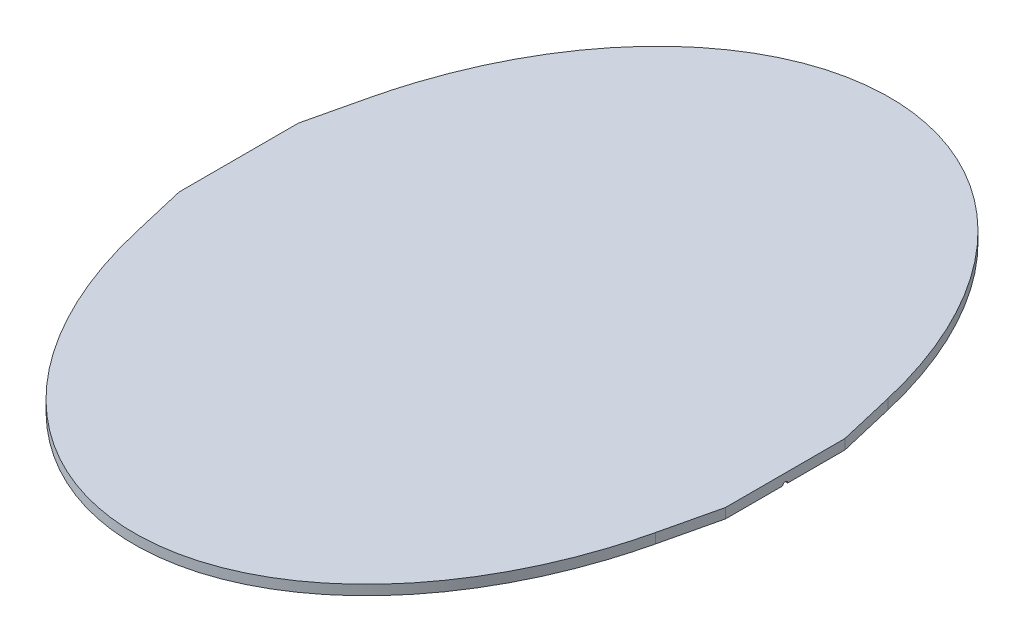
ISO-10303-21;
HEADER;
FILE_DESCRIPTION(('STEP AP214'),'2;1');
FILE_NAME('part.step','',(''),(''),'','','');
FILE_SCHEMA(('AUTOMOTIVE_DESIGN { 1 0 10303 214 1 1 1 1 }'));
ENDSEC;
DATA;
#1=APPLICATION_CONTEXT('core data for automotive mechanical design processes');
#2=APPLICATION_PROTOCOL_DEFINITION('international standard','automotive_design',2000,#1);
#3=PRODUCT_CONTEXT('',#1,'mechanical');
#4=PRODUCT('Part','Part','',(#3));
#5=PRODUCT_RELATED_PRODUCT_CATEGORY('part','',(#4));
#6=PRODUCT_DEFINITION_FORMATION('','',#4);
#7=PRODUCT_DEFINITION_CONTEXT('part definition',#1,'design');
#8=PRODUCT_DEFINITION('design','',#6,#7);
#9=PRODUCT_DEFINITION_SHAPE('','',#8);
#10=(LENGTH_UNIT() NAMED_UNIT(*) SI_UNIT(.MILLI.,.METRE.));
#11=(NAMED_UNIT(*) PLANE_ANGLE_UNIT() SI_UNIT($,.RADIAN.));
#12=(NAMED_UNIT(*) SI_UNIT($,.STERADIAN.) SOLID_ANGLE_UNIT());
#13=UNCERTAINTY_MEASURE_WITH_UNIT(LENGTH_MEASURE(1.E-05),#10,'distance_accuracy_value','');
#14=(GEOMETRIC_REPRESENTATION_CONTEXT(3) GLOBAL_UNCERTAINTY_ASSIGNED_CONTEXT((#13)) GLOBAL_UNIT_ASSIGNED_CONTEXT((#10,
#11,#12)) REPRESENTATION_CONTEXT('',''));
#15=CARTESIAN_POINT('',(0.,0.,0.));
#16=DIRECTION('',(0.,0.,1.));
#17=DIRECTION('',(1.,0.,0.));
#18=AXIS2_PLACEMENT_3D('',#15,#16,#17);
#19=CARTESIAN_POINT('',(0.,10.,0.));
#20=DIRECTION('',(0.,1.,0.));
#21=DIRECTION('',(0.,0.,-1.));
#22=AXIS2_PLACEMENT_3D('',#19,#20,#21);
#23=ELLIPSE('',#22,380.,275.);
#24=DIRECTION('',(0.,-1.,0.));
#25=VECTOR('',#24,1.);
#26=SURFACE_OF_LINEAR_EXTRUSION('',#23,#25);
#27=CARTESIAN_POINT('',(0.,0.,0.));
#28=DIRECTION('',(0.,1.,0.));
#29=DIRECTION('',(0.,0.,-1.));
#30=AXIS2_PLACEMENT_3D('',#27,#28,#29);
#31=ELLIPSE('',#30,380.,275.);
#32=CARTESIAN_POINT('',(261.621621621622,0.,-117.081081081081));
#33=VERTEX_POINT('',#32);
#34=CARTESIAN_POINT('',(-261.621621621622,0.,-117.081081081081));
#35=VERTEX_POINT('',#34);
#36=EDGE_CURVE('E38',#33,#35,#31,.T.);
#37=ORIENTED_EDGE('',*,*,#36,.T.);
#38=DIRECTION('',(0.,1.,0.));
#39=VECTOR('',#38,1.);
#40=CARTESIAN_POINT('',(-261.621621621622,0.,-117.081081081081));
#41=LINE('',#40,#39);
#42=CARTESIAN_POINT('',(-261.621621621622,10.,-117.081081081081));
#43=VERTEX_POINT('',#42);
#44=EDGE_CURVE('E178',#35,#43,#41,.T.);
#45=ORIENTED_EDGE('',*,*,#44,.T.);
#46=CARTESIAN_POINT('',(261.621621621622,10.,-117.081081081081));
#47=VERTEX_POINT('',#46);
#48=EDGE_CURVE('E11',#47,#43,#23,.T.);
#49=ORIENTED_EDGE('',*,*,#48,.F.);
#50=DIRECTION('',(0.,1.,0.));
#51=VECTOR('',#50,1.);
#52=CARTESIAN_POINT('',(261.621621621622,0.,-117.081081081081));
#53=LINE('',#52,#51);
#54=EDGE_CURVE('E199',#33,#47,#53,.T.);
#55=ORIENTED_EDGE('',*,*,#54,.F.);
#56=EDGE_LOOP('',(#37,#45,#49,#55));
#57=FACE_BOUND('',#56,.T.);
#58=ADVANCED_FACE('F33',(#57),#26,.F.);
#59=CARTESIAN_POINT('',(-261.621621621622,10.,117.081081081081));
#60=VERTEX_POINT('',#59);
#61=CARTESIAN_POINT('',(261.621621621622,10.,117.081081081081));
#62=VERTEX_POINT('',#61);
#63=EDGE_CURVE('E42',#60,#62,#23,.T.);
#64=ORIENTED_EDGE('',*,*,#63,.F.);
#65=DIRECTION('',(0.,1.,0.));
#66=VECTOR('',#65,1.);
#67=CARTESIAN_POINT('',(-261.621621621622,0.,117.081081081081));
#68=LINE('',#67,#66);
#69=CARTESIAN_POINT('',(-261.621621621622,0.,117.081081081081));
#70=VERTEX_POINT('',#69);
#71=EDGE_CURVE('E164',#70,#60,#68,.T.);
#72=ORIENTED_EDGE('',*,*,#71,.F.);
#73=CARTESIAN_POINT('',(261.621621621622,0.,117.081081081081));
#74=VERTEX_POINT('',#73);
#75=EDGE_CURVE('E201',#70,#74,#31,.T.);
#76=ORIENTED_EDGE('',*,*,#75,.T.);
#77=DIRECTION('',(0.,1.,0.));
#78=VECTOR('',#77,1.);
#79=CARTESIAN_POINT('',(261.621621621622,0.,117.081081081081));
#80=LINE('',#79,#78);
#81=EDGE_CURVE('E192',#74,#62,#80,.T.);
#82=ORIENTED_EDGE('',*,*,#81,.T.);
#83=EDGE_LOOP('',(#64,#72,#76,#82));
#84=FACE_BOUND('',#83,.T.);
#85=ADVANCED_FACE('F35',(#84),#26,.F.);
#86=CARTESIAN_POINT('',(0.,10.,0.));
#87=DIRECTION('',(0.,1.,0.));
#88=DIRECTION('',(0.,0.,1.));
#89=AXIS2_PLACEMENT_3D('',#86,#87,#88);
#90=PLANE('',#89);
#91=ORIENTED_EDGE('',*,*,#48,.T.);
#92=DIRECTION('',(-0.228191322789328,0.,0.973616310567801));
#93=VECTOR('',#92,1.);
#94=CARTESIAN_POINT('',(-261.621621621622,10.,-117.081081081081));
#95=LINE('',#94,#93);
#96=CARTESIAN_POINT('',(-275.,10.,-60.));
#97=VERTEX_POINT('',#96);
#98=EDGE_CURVE('E167',#43,#97,#95,.T.);
#99=ORIENTED_EDGE('',*,*,#98,.T.);
#100=DIRECTION('',(0.,0.,1.));
#101=VECTOR('',#100,1.);
#102=CARTESIAN_POINT('',(-275.,10.,0.));
#103=LINE('',#102,#101);
#104=CARTESIAN_POINT('',(-275.,10.,60.));
#105=VERTEX_POINT('',#104);
#106=EDGE_CURVE('E158',#97,#105,#103,.T.);
#107=ORIENTED_EDGE('',*,*,#106,.T.);
#108=DIRECTION('',(0.228191322789329,0.,0.973616310567801));
#109=VECTOR('',#108,1.);
#110=CARTESIAN_POINT('',(-275.,10.,60.));
#111=LINE('',#110,#109);
#112=EDGE_CURVE('E152',#105,#60,#111,.T.);
#113=ORIENTED_EDGE('',*,*,#112,.T.);
#114=ORIENTED_EDGE('',*,*,#63,.T.);
#115=DIRECTION('',(0.228191322789329,0.,-0.973616310567801));
#116=VECTOR('',#115,1.);
#117=CARTESIAN_POINT('',(275.,10.,60.));
#118=LINE('',#117,#116);
#119=CARTESIAN_POINT('',(275.,10.,60.));
#120=VERTEX_POINT('',#119);
#121=EDGE_CURVE('E174',#62,#120,#118,.T.);
#122=ORIENTED_EDGE('',*,*,#121,.T.);
#123=DIRECTION('',(0.,0.,-1.));
#124=VECTOR('',#123,1.);
#125=CARTESIAN_POINT('',(275.,10.,-60.));
#126=LINE('',#125,#124);
#127=CARTESIAN_POINT('',(275.,10.,-60.));
#128=VERTEX_POINT('',#127);
#129=EDGE_CURVE('E195',#120,#128,#126,.T.);
#130=ORIENTED_EDGE('',*,*,#129,.T.);
#131=DIRECTION('',(-0.228191322789328,0.,-0.973616310567801));
#132=VECTOR('',#131,1.);
#133=CARTESIAN_POINT('',(261.621621621622,10.,-117.081081081081));
#134=LINE('',#133,#132);
#135=EDGE_CURVE('E186',#128,#47,#134,.T.);
#136=ORIENTED_EDGE('',*,*,#135,.T.);
#137=EDGE_LOOP('',(#91,#99,#107,#113,#114,#122,#130,#136));
#138=FACE_BOUND('',#137,.T.);
#139=ADVANCED_FACE('F226',(#138),#90,.T.);
#140=CARTESIAN_POINT('',(0.,0.,0.));
#141=DIRECTION('',(0.,1.,0.));
#142=DIRECTION('',(0.,0.,1.));
#143=AXIS2_PLACEMENT_3D('',#140,#141,#142);
#144=PLANE('',#143);
#145=DIRECTION('',(0.,0.,1.));
#146=VECTOR('',#145,1.);
#147=CARTESIAN_POINT('',(-265.,0.,-2.5));
#148=LINE('',#147,#146);
#149=CARTESIAN_POINT('',(-265.,0.,-2.5));
#150=VERTEX_POINT('',#149);
#151=CARTESIAN_POINT('',(-265.,0.,2.50000000000001));
#152=VERTEX_POINT('',#151);
#153=EDGE_CURVE('E131',#150,#152,#148,.T.);
#154=ORIENTED_EDGE('',*,*,#153,.F.);
#155=DIRECTION('',(-1.,0.,0.));
#156=VECTOR('',#155,1.);
#157=CARTESIAN_POINT('',(-265.,0.,-2.5));
#158=LINE('',#157,#156);
#159=CARTESIAN_POINT('',(-275.,0.,-2.5));
#160=VERTEX_POINT('',#159);
#161=EDGE_CURVE('E121',#150,#160,#158,.T.);
#162=ORIENTED_EDGE('',*,*,#161,.T.);
#163=DIRECTION('',(0.,0.,1.));
#164=VECTOR('',#163,1.);
#165=CARTESIAN_POINT('',(-275.,0.,-60.));
#166=LINE('',#165,#164);
#167=CARTESIAN_POINT('',(-275.,0.,-60.));
#168=VERTEX_POINT('',#167);
#169=EDGE_CURVE('E162',#168,#160,#166,.T.);
#170=ORIENTED_EDGE('',*,*,#169,.F.);
#171=DIRECTION('',(-0.228191322789328,0.,0.973616310567801));
#172=VECTOR('',#171,1.);
#173=CARTESIAN_POINT('',(-261.621621621622,0.,-117.081081081081));
#174=LINE('',#173,#172);
#175=EDGE_CURVE('E157',#35,#168,#174,.T.);
#176=ORIENTED_EDGE('',*,*,#175,.F.);
#177=ORIENTED_EDGE('',*,*,#36,.F.);
#178=DIRECTION('',(-0.228191322789328,0.,-0.973616310567801));
#179=VECTOR('',#178,1.);
#180=CARTESIAN_POINT('',(261.621621621622,0.,-117.081081081081));
#181=LINE('',#180,#179);
#182=CARTESIAN_POINT('',(275.,0.,-60.));
#183=VERTEX_POINT('',#182);
#184=EDGE_CURVE('E190',#183,#33,#181,.T.);
#185=ORIENTED_EDGE('',*,*,#184,.F.);
#186=DIRECTION('',(0.,0.,-1.));
#187=VECTOR('',#186,1.);
#188=CARTESIAN_POINT('',(275.,0.,0.));
#189=LINE('',#188,#187);
#190=CARTESIAN_POINT('',(275.,0.,-2.49999999999999));
#191=VERTEX_POINT('',#190);
#192=EDGE_CURVE('E185',#191,#183,#189,.T.);
#193=ORIENTED_EDGE('',*,*,#192,.F.);
#194=DIRECTION('',(1.,0.,0.));
#195=VECTOR('',#194,1.);
#196=CARTESIAN_POINT('',(265.,0.,-2.5));
#197=LINE('',#196,#195);
#198=CARTESIAN_POINT('',(265.,0.,-2.5));
#199=VERTEX_POINT('',#198);
#200=EDGE_CURVE('E57',#199,#191,#197,.T.);
#201=ORIENTED_EDGE('',*,*,#200,.F.);
#202=DIRECTION('',(0.,0.,-1.));
#203=VECTOR('',#202,1.);
#204=CARTESIAN_POINT('',(265.,0.,2.5));
#205=LINE('',#204,#203);
#206=CARTESIAN_POINT('',(265.,0.,2.5));
#207=VERTEX_POINT('',#206);
#208=EDGE_CURVE('E146',#207,#199,#205,.T.);
#209=ORIENTED_EDGE('',*,*,#208,.F.);
#210=DIRECTION('',(1.,0.,0.));
#211=VECTOR('',#210,1.);
#212=CARTESIAN_POINT('',(265.,0.,2.5));
#213=LINE('',#212,#211);
#214=CARTESIAN_POINT('',(275.,0.,2.5));
#215=VERTEX_POINT('',#214);
#216=EDGE_CURVE('E149',#207,#215,#213,.T.);
#217=ORIENTED_EDGE('',*,*,#216,.T.);
#218=CARTESIAN_POINT('',(275.,0.,60.));
#219=VERTEX_POINT('',#218);
#220=EDGE_CURVE('E187',#219,#215,#189,.T.);
#221=ORIENTED_EDGE('',*,*,#220,.F.);
#222=DIRECTION('',(0.228191322789329,0.,-0.973616310567801));
#223=VECTOR('',#222,1.);
#224=CARTESIAN_POINT('',(275.,0.,60.));
#225=LINE('',#224,#223);
#226=EDGE_CURVE('E182',#74,#219,#225,.T.);
#227=ORIENTED_EDGE('',*,*,#226,.F.);
#228=ORIENTED_EDGE('',*,*,#75,.F.);
#229=DIRECTION('',(0.228191322789329,0.,0.973616310567801));
#230=VECTOR('',#229,1.);
#231=CARTESIAN_POINT('',(-275.,0.,60.));
#232=LINE('',#231,#230);
#233=CARTESIAN_POINT('',(-275.,0.,60.));
#234=VERTEX_POINT('',#233);
#235=EDGE_CURVE('E155',#234,#70,#232,.T.);
#236=ORIENTED_EDGE('',*,*,#235,.F.);
#237=CARTESIAN_POINT('',(-275.,0.,2.5));
#238=VERTEX_POINT('',#237);
#239=EDGE_CURVE('E161',#238,#234,#166,.T.);
#240=ORIENTED_EDGE('',*,*,#239,.F.);
#241=DIRECTION('',(-1.,0.,0.));
#242=VECTOR('',#241,1.);
#243=CARTESIAN_POINT('',(-265.,0.,2.50000000000001));
#244=LINE('',#243,#242);
#245=EDGE_CURVE('E49',#152,#238,#244,.T.);
#246=ORIENTED_EDGE('',*,*,#245,.F.);
#247=EDGE_LOOP('',(#154,#162,#170,#176,#177,#185,#193,#201,#209,#217,#221,#227,#228,#236,#240,#246));
#248=FACE_BOUND('',#247,.T.);
#249=ADVANCED_FACE('F136',(#248),#144,.F.);
#250=CARTESIAN_POINT('',(275.,0.,-60.));
#251=DIRECTION('',(1.,0.,0.));
#252=DIRECTION('',(0.,0.,-1.));
#253=AXIS2_PLACEMENT_3D('',#250,#251,#252);
#254=PLANE('',#253);
#255=CARTESIAN_POINT('',(275.,0.,0.));
#256=DIRECTION('',(1.,0.,0.));
#257=DIRECTION('',(0.,0.,-1.));
#258=AXIS2_PLACEMENT_3D('',#255,#256,#257);
#259=CIRCLE('',#258,2.5);
#260=EDGE_CURVE('E141',#191,#215,#259,.T.);
#261=ORIENTED_EDGE('',*,*,#260,.F.);
#262=ORIENTED_EDGE('',*,*,#192,.T.);
#263=DIRECTION('',(0.,1.,0.));
#264=VECTOR('',#263,1.);
#265=CARTESIAN_POINT('',(275.,0.,-60.));
#266=LINE('',#265,#264);
#267=EDGE_CURVE('E202',#183,#128,#266,.T.);
#268=ORIENTED_EDGE('',*,*,#267,.T.);
#269=ORIENTED_EDGE('',*,*,#129,.F.);
#270=DIRECTION('',(0.,1.,0.));
#271=VECTOR('',#270,1.);
#272=CARTESIAN_POINT('',(275.,0.,60.));
#273=LINE('',#272,#271);
#274=EDGE_CURVE('E205',#219,#120,#273,.T.);
#275=ORIENTED_EDGE('',*,*,#274,.F.);
#276=ORIENTED_EDGE('',*,*,#220,.T.);
#277=EDGE_LOOP('',(#261,#262,#268,#269,#275,#276));
#278=FACE_BOUND('',#277,.T.);
#279=ADVANCED_FACE('F223',(#278),#254,.T.);
#280=CARTESIAN_POINT('',(261.621621621622,0.,-117.081081081081));
#281=DIRECTION('',(0.973616310567801,0.,-0.228191322789328));
#282=DIRECTION('',(-0.228191322789328,0.,-0.973616310567801));
#283=AXIS2_PLACEMENT_3D('',#280,#281,#282);
#284=PLANE('',#283);
#285=ORIENTED_EDGE('',*,*,#135,.F.);
#286=ORIENTED_EDGE('',*,*,#267,.F.);
#287=ORIENTED_EDGE('',*,*,#184,.T.);
#288=ORIENTED_EDGE('',*,*,#54,.T.);
#289=EDGE_LOOP('',(#285,#286,#287,#288));
#290=FACE_BOUND('',#289,.T.);
#291=ADVANCED_FACE('F240',(#290),#284,.T.);
#292=CARTESIAN_POINT('',(275.,0.,60.));
#293=DIRECTION('',(0.973616310567801,0.,0.228191322789329));
#294=DIRECTION('',(0.228191322789329,0.,-0.973616310567801));
#295=AXIS2_PLACEMENT_3D('',#292,#293,#294);
#296=PLANE('',#295);
#297=ORIENTED_EDGE('',*,*,#121,.F.);
#298=ORIENTED_EDGE('',*,*,#81,.F.);
#299=ORIENTED_EDGE('',*,*,#226,.T.);
#300=ORIENTED_EDGE('',*,*,#274,.T.);
#301=EDGE_LOOP('',(#297,#298,#299,#300));
#302=FACE_BOUND('',#301,.T.);
#303=ADVANCED_FACE('F218',(#302),#296,.T.);
#304=CARTESIAN_POINT('',(-275.,0.,0.));
#305=DIRECTION('',(-1.,0.,0.));
#306=DIRECTION('',(0.,0.,1.));
#307=AXIS2_PLACEMENT_3D('',#304,#305,#306);
#308=PLANE('',#307);
#309=CARTESIAN_POINT('',(-275.,0.,0.));
#310=DIRECTION('',(-1.,0.,0.));
#311=DIRECTION('',(0.,0.,1.));
#312=AXIS2_PLACEMENT_3D('',#309,#310,#311);
#313=CIRCLE('',#312,2.5);
#314=EDGE_CURVE('E126',#238,#160,#313,.T.);
#315=ORIENTED_EDGE('',*,*,#314,.F.);
#316=ORIENTED_EDGE('',*,*,#239,.T.);
#317=DIRECTION('',(0.,1.,0.));
#318=VECTOR('',#317,1.);
#319=CARTESIAN_POINT('',(-275.,0.,60.));
#320=LINE('',#319,#318);
#321=EDGE_CURVE('E171',#234,#105,#320,.T.);
#322=ORIENTED_EDGE('',*,*,#321,.T.);
#323=ORIENTED_EDGE('',*,*,#106,.F.);
#324=DIRECTION('',(0.,1.,0.));
#325=VECTOR('',#324,1.);
#326=CARTESIAN_POINT('',(-275.,0.,-60.));
#327=LINE('',#326,#325);
#328=EDGE_CURVE('E175',#168,#97,#327,.T.);
#329=ORIENTED_EDGE('',*,*,#328,.F.);
#330=ORIENTED_EDGE('',*,*,#169,.T.);
#331=EDGE_LOOP('',(#315,#316,#322,#323,#329,#330));
#332=FACE_BOUND('',#331,.T.);
#333=ADVANCED_FACE('F269',(#332),#308,.T.);
#334=CARTESIAN_POINT('',(-275.,0.,60.));
#335=DIRECTION('',(-0.973616310567801,0.,0.228191322789329));
#336=DIRECTION('',(0.228191322789329,0.,0.973616310567801));
#337=AXIS2_PLACEMENT_3D('',#334,#335,#336);
#338=PLANE('',#337);
#339=ORIENTED_EDGE('',*,*,#112,.F.);
#340=ORIENTED_EDGE('',*,*,#321,.F.);
#341=ORIENTED_EDGE('',*,*,#235,.T.);
#342=ORIENTED_EDGE('',*,*,#71,.T.);
#343=EDGE_LOOP('',(#339,#340,#341,#342));
#344=FACE_BOUND('',#343,.T.);
#345=ADVANCED_FACE('F251',(#344),#338,.T.);
#346=CARTESIAN_POINT('',(-261.621621621622,0.,-117.081081081081));
#347=DIRECTION('',(-0.973616310567801,0.,-0.228191322789328));
#348=DIRECTION('',(-0.228191322789328,0.,0.973616310567801));
#349=AXIS2_PLACEMENT_3D('',#346,#347,#348);
#350=PLANE('',#349);
#351=ORIENTED_EDGE('',*,*,#98,.F.);
#352=ORIENTED_EDGE('',*,*,#44,.F.);
#353=ORIENTED_EDGE('',*,*,#175,.T.);
#354=ORIENTED_EDGE('',*,*,#328,.T.);
#355=EDGE_LOOP('',(#351,#352,#353,#354));
#356=FACE_BOUND('',#355,.T.);
#357=ADVANCED_FACE('F236',(#356),#350,.T.);
#358=CARTESIAN_POINT('',(265.,0.,0.));
#359=DIRECTION('',(1.,0.,0.));
#360=DIRECTION('',(0.,0.,-1.));
#361=AXIS2_PLACEMENT_3D('',#358,#359,#360);
#362=CYLINDRICAL_SURFACE('',#361,2.5);
#363=ORIENTED_EDGE('',*,*,#260,.T.);
#364=ORIENTED_EDGE('',*,*,#216,.F.);
#365=CARTESIAN_POINT('',(265.,0.,0.));
#366=DIRECTION('',(1.,0.,0.));
#367=DIRECTION('',(0.,0.,-1.));
#368=AXIS2_PLACEMENT_3D('',#365,#366,#367);
#369=CIRCLE('',#368,2.5);
#370=EDGE_CURVE('E143',#199,#207,#369,.T.);
#371=ORIENTED_EDGE('',*,*,#370,.F.);
#372=ORIENTED_EDGE('',*,*,#200,.T.);
#373=EDGE_LOOP('',(#363,#364,#371,#372));
#374=FACE_BOUND('',#373,.T.);
#375=ADVANCED_FACE('F243',(#374),#362,.F.);
#376=CARTESIAN_POINT('',(265.,0.,0.));
#377=DIRECTION('',(1.,0.,0.));
#378=DIRECTION('',(0.,0.,-1.));
#379=AXIS2_PLACEMENT_3D('',#376,#377,#378);
#380=PLANE('',#379);
#381=ORIENTED_EDGE('',*,*,#370,.T.);
#382=ORIENTED_EDGE('',*,*,#208,.T.);
#383=EDGE_LOOP('',(#381,#382));
#384=FACE_BOUND('',#383,.T.);
#385=ADVANCED_FACE('F242',(#384),#380,.T.);
#386=CARTESIAN_POINT('',(-265.,0.,0.));
#387=DIRECTION('',(-1.,0.,0.));
#388=DIRECTION('',(0.,0.,1.));
#389=AXIS2_PLACEMENT_3D('',#386,#387,#388);
#390=CYLINDRICAL_SURFACE('',#389,2.5);
#391=ORIENTED_EDGE('',*,*,#314,.T.);
#392=ORIENTED_EDGE('',*,*,#161,.F.);
#393=CARTESIAN_POINT('',(-265.,0.,0.));
#394=DIRECTION('',(-1.,0.,0.));
#395=DIRECTION('',(0.,0.,1.));
#396=AXIS2_PLACEMENT_3D('',#393,#394,#395);
#397=CIRCLE('',#396,2.5);
#398=EDGE_CURVE('E124',#152,#150,#397,.T.);
#399=ORIENTED_EDGE('',*,*,#398,.F.);
#400=ORIENTED_EDGE('',*,*,#245,.T.);
#401=EDGE_LOOP('',(#391,#392,#399,#400));
#402=FACE_BOUND('',#401,.T.);
#403=ADVANCED_FACE('F123',(#402),#390,.F.);
#404=CARTESIAN_POINT('',(-265.,0.,0.));
#405=DIRECTION('',(-1.,0.,0.));
#406=DIRECTION('',(0.,0.,1.));
#407=AXIS2_PLACEMENT_3D('',#404,#405,#406);
#408=PLANE('',#407);
#409=ORIENTED_EDGE('',*,*,#398,.T.);
#410=ORIENTED_EDGE('',*,*,#153,.T.);
#411=EDGE_LOOP('',(#409,#410));
#412=FACE_BOUND('',#411,.T.);
#413=ADVANCED_FACE('F134',(#412),#408,.T.);
#414=CLOSED_SHELL('',(#58,#85,#139,#249,#279,#291,#303,#333,#345,#357,#375,#385,#403,#413));
#415=MANIFOLD_SOLID_BREP('B2',#414);
#416=ADVANCED_BREP_SHAPE_REPRESENTATION('',(#18,#415),#14);
#417=SHAPE_DEFINITION_REPRESENTATION(#9,#416);
ENDSEC;
END-ISO-10303-21;
